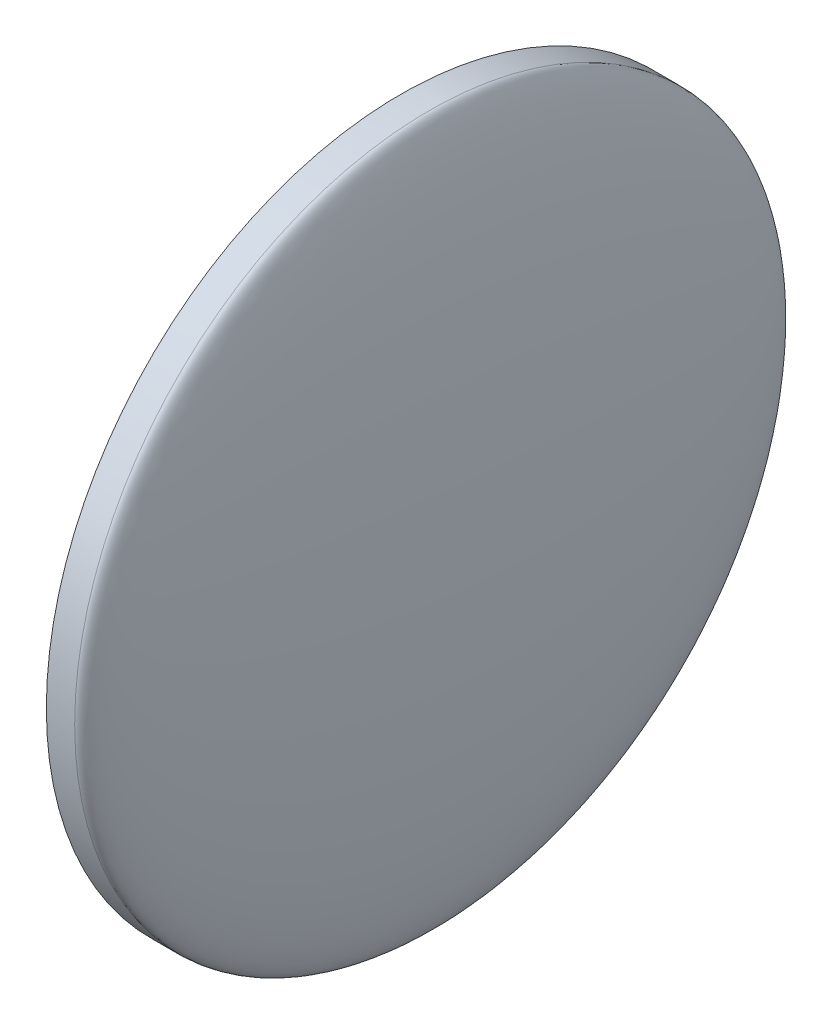
ISO-10303-21;
HEADER;
FILE_DESCRIPTION(('STEP AP214'),'2;1');
FILE_NAME('part.step','',(''),(''),'','','');
FILE_SCHEMA(('AUTOMOTIVE_DESIGN { 1 0 10303 214 1 1 1 1 }'));
ENDSEC;
DATA;
#1=APPLICATION_CONTEXT('core data for automotive mechanical design processes');
#2=APPLICATION_PROTOCOL_DEFINITION('international standard','automotive_design',2000,#1);
#3=PRODUCT_CONTEXT('',#1,'mechanical');
#4=PRODUCT('Part','Part','',(#3));
#5=PRODUCT_RELATED_PRODUCT_CATEGORY('part','',(#4));
#6=PRODUCT_DEFINITION_FORMATION('','',#4);
#7=PRODUCT_DEFINITION_CONTEXT('part definition',#1,'design');
#8=PRODUCT_DEFINITION('design','',#6,#7);
#9=PRODUCT_DEFINITION_SHAPE('','',#8);
#10=(LENGTH_UNIT() NAMED_UNIT(*) SI_UNIT(.MILLI.,.METRE.));
#11=(NAMED_UNIT(*) PLANE_ANGLE_UNIT() SI_UNIT($,.RADIAN.));
#12=(NAMED_UNIT(*) SI_UNIT($,.STERADIAN.) SOLID_ANGLE_UNIT());
#13=UNCERTAINTY_MEASURE_WITH_UNIT(LENGTH_MEASURE(1.E-05),#10,'distance_accuracy_value','');
#14=(GEOMETRIC_REPRESENTATION_CONTEXT(3) GLOBAL_UNCERTAINTY_ASSIGNED_CONTEXT((#13)) GLOBAL_UNIT_ASSIGNED_CONTEXT((#10,
#11,#12)) REPRESENTATION_CONTEXT('',''));
#15=CARTESIAN_POINT('',(0.,0.,0.));
#16=DIRECTION('',(0.,0.,1.));
#17=DIRECTION('',(1.,0.,0.));
#18=AXIS2_PLACEMENT_3D('',#15,#16,#17);
#19=CARTESIAN_POINT('',(1.,0.,0.));
#20=DIRECTION('',(0.,-1.,0.));
#21=DIRECTION('',(0.,0.,-1.));
#22=AXIS2_PLACEMENT_3D('',#19,#20,#21);
#23=ELLIPSE('',#22,12.5,1.27378866088657);
#24=TRIMMED_CURVE('',#23,(PARAMETER_VALUE(-1.5707963267949)),(PARAMETER_VALUE(1.5707963267949)),
.T.,.PARAMETER.);
#25=CARTESIAN_POINT('',(0.,0.,0.));
#26=DIRECTION('',(-1.,0.,0.));
#27=AXIS1_PLACEMENT('',#25,#26);
#28=SURFACE_OF_REVOLUTION('',#24,#27);
#29=CARTESIAN_POINT('',(2.27378866088657,0.,0.));
#30=VERTEX_POINT('',#29);
#31=VERTEX_LOOP('',#30);
#32=FACE_BOUND('',#31,.T.);
#33=CARTESIAN_POINT('',(1.,0.,0.));
#34=DIRECTION('',(-1.,0.,0.));
#35=DIRECTION('',(0.,0.,1.));
#36=AXIS2_PLACEMENT_3D('',#33,#34,#35);
#37=CIRCLE('',#36,12.5);
#38=CARTESIAN_POINT('',(1.,0.,12.5));
#39=VERTEX_POINT('',#38);
#40=EDGE_CURVE('E11',#39,#39,#37,.T.);
#41=ORIENTED_EDGE('',*,*,#40,.F.);
#42=EDGE_LOOP('',(#41));
#43=FACE_BOUND('',#42,.T.);
#44=ADVANCED_FACE('F34',(#32,#43),#28,.F.);
#45=CARTESIAN_POINT('',(0.,0.,0.));
#46=DIRECTION('',(-1.,0.,0.));
#47=DIRECTION('',(0.,0.,1.));
#48=AXIS2_PLACEMENT_3D('',#45,#46,#47);
#49=CYLINDRICAL_SURFACE('',#48,12.5);
#50=ORIENTED_EDGE('',*,*,#40,.T.);
#51=EDGE_LOOP('',(#50));
#52=FACE_BOUND('',#51,.T.);
#53=CARTESIAN_POINT('',(0.,0.,0.));
#54=DIRECTION('',(-1.,0.,0.));
#55=DIRECTION('',(0.,0.,1.));
#56=AXIS2_PLACEMENT_3D('',#53,#54,#55);
#57=CIRCLE('',#56,12.5);
#58=CARTESIAN_POINT('',(0.,0.,12.5));
#59=VERTEX_POINT('',#58);
#60=EDGE_CURVE('E41',#59,#59,#57,.T.);
#61=ORIENTED_EDGE('',*,*,#60,.F.);
#62=EDGE_LOOP('',(#61));
#63=FACE_BOUND('',#62,.T.);
#64=ADVANCED_FACE('F46',(#52,#63),#49,.T.);
#65=CARTESIAN_POINT('',(0.,0.,0.));
#66=DIRECTION('',(-1.,0.,0.));
#67=DIRECTION('',(0.,0.,1.));
#68=AXIS2_PLACEMENT_3D('',#65,#66,#67);
#69=PLANE('',#68);
#70=ORIENTED_EDGE('',*,*,#60,.T.);
#71=EDGE_LOOP('',(#70));
#72=FACE_BOUND('',#71,.T.);
#73=ADVANCED_FACE('F51',(#72),#69,.T.);
#74=CLOSED_SHELL('',(#44,#64,#73));
#75=MANIFOLD_SOLID_BREP('B2',#74);
#76=ADVANCED_BREP_SHAPE_REPRESENTATION('',(#18,#75),#14);
#77=SHAPE_DEFINITION_REPRESENTATION(#9,#76);
ENDSEC;
END-ISO-10303-21;
